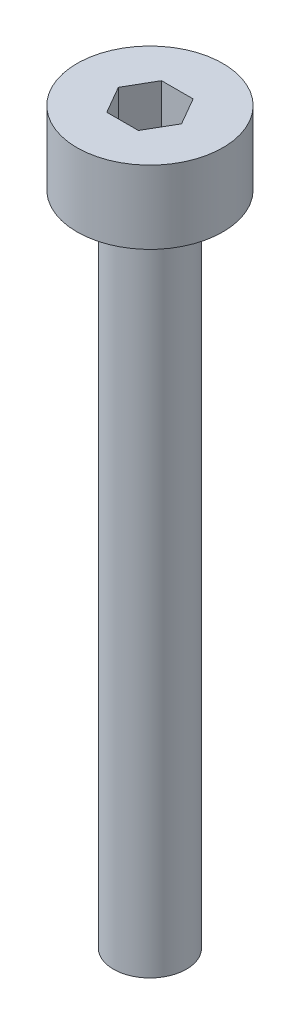
ISO-10303-21;
HEADER;
FILE_DESCRIPTION(('STEP AP214'),'2;1');
FILE_NAME('part.step','',(''),(''),'','','');
FILE_SCHEMA(('AUTOMOTIVE_DESIGN { 1 0 10303 214 1 1 1 1 }'));
ENDSEC;
DATA;
#1=APPLICATION_CONTEXT('core data for automotive mechanical design processes');
#2=APPLICATION_PROTOCOL_DEFINITION('international standard','automotive_design',2000,#1);
#3=PRODUCT_CONTEXT('',#1,'mechanical');
#4=PRODUCT('Part','Part','',(#3));
#5=PRODUCT_RELATED_PRODUCT_CATEGORY('part','',(#4));
#6=PRODUCT_DEFINITION_FORMATION('','',#4);
#7=PRODUCT_DEFINITION_CONTEXT('part definition',#1,'design');
#8=PRODUCT_DEFINITION('design','',#6,#7);
#9=PRODUCT_DEFINITION_SHAPE('','',#8);
#10=(LENGTH_UNIT() NAMED_UNIT(*) SI_UNIT(.MILLI.,.METRE.));
#11=(NAMED_UNIT(*) PLANE_ANGLE_UNIT() SI_UNIT($,.RADIAN.));
#12=(NAMED_UNIT(*) SI_UNIT($,.STERADIAN.) SOLID_ANGLE_UNIT());
#13=UNCERTAINTY_MEASURE_WITH_UNIT(LENGTH_MEASURE(1.E-05),#10,'distance_accuracy_value','');
#14=(GEOMETRIC_REPRESENTATION_CONTEXT(3) GLOBAL_UNCERTAINTY_ASSIGNED_CONTEXT((#13)) GLOBAL_UNIT_ASSIGNED_CONTEXT((#10,
#11,#12)) REPRESENTATION_CONTEXT('',''));
#15=CARTESIAN_POINT('',(0.,0.,0.));
#16=DIRECTION('',(0.,0.,1.));
#17=DIRECTION('',(1.,0.,0.));
#18=AXIS2_PLACEMENT_3D('',#15,#16,#17);
#19=CARTESIAN_POINT('',(0.,2.,0.));
#20=DIRECTION('',(0.,-1.,0.));
#21=DIRECTION('',(0.,0.,-1.));
#22=AXIS2_PLACEMENT_3D('',#19,#20,#21);
#23=CYLINDRICAL_SURFACE('',#22,2.);
#24=CARTESIAN_POINT('',(0.,2.,0.));
#25=DIRECTION('',(0.,1.,0.));
#26=DIRECTION('',(0.,0.,1.));
#27=AXIS2_PLACEMENT_3D('',#24,#25,#26);
#28=CIRCLE('',#27,2.);
#29=CARTESIAN_POINT('',(0.,2.,2.));
#30=VERTEX_POINT('',#29);
#31=EDGE_CURVE('E42',#30,#30,#28,.T.);
#32=ORIENTED_EDGE('',*,*,#31,.F.);
#33=EDGE_LOOP('',(#32));
#34=FACE_BOUND('',#33,.T.);
#35=CARTESIAN_POINT('',(0.,0.,0.));
#36=DIRECTION('',(0.,1.,0.));
#37=DIRECTION('',(0.,0.,1.));
#38=AXIS2_PLACEMENT_3D('',#35,#36,#37);
#39=CIRCLE('',#38,2.);
#40=CARTESIAN_POINT('',(0.,0.,2.));
#41=VERTEX_POINT('',#40);
#42=EDGE_CURVE('E37',#41,#41,#39,.T.);
#43=ORIENTED_EDGE('',*,*,#42,.T.);
#44=EDGE_LOOP('',(#43));
#45=FACE_BOUND('',#44,.T.);
#46=ADVANCED_FACE('F34',(#34,#45),#23,.T.);
#47=CARTESIAN_POINT('',(0.,2.,0.));
#48=DIRECTION('',(0.,1.,0.));
#49=DIRECTION('',(0.,0.,1.));
#50=AXIS2_PLACEMENT_3D('',#47,#48,#49);
#51=PLANE('',#50);
#52=DIRECTION('',(0.5,0.,-0.866025403784439));
#53=VECTOR('',#52,1.);
#54=CARTESIAN_POINT('',(0.433012701892219,2.,0.75));
#55=LINE('',#54,#53);
#56=CARTESIAN_POINT('',(0.433012701892219,2.,0.75));
#57=VERTEX_POINT('',#56);
#58=CARTESIAN_POINT('',(0.866025403784438,2.,0.));
#59=VERTEX_POINT('',#58);
#60=EDGE_CURVE('E50',#57,#59,#55,.T.);
#61=ORIENTED_EDGE('',*,*,#60,.F.);
#62=DIRECTION('',(1.,0.,0.));
#63=VECTOR('',#62,1.);
#64=CARTESIAN_POINT('',(-0.43301270189222,2.,0.75));
#65=LINE('',#64,#63);
#66=CARTESIAN_POINT('',(-0.43301270189222,2.,0.75));
#67=VERTEX_POINT('',#66);
#68=EDGE_CURVE('E134',#67,#57,#65,.T.);
#69=ORIENTED_EDGE('',*,*,#68,.F.);
#70=DIRECTION('',(0.5,0.,0.866025403784439));
#71=VECTOR('',#70,1.);
#72=CARTESIAN_POINT('',(-0.866025403784439,2.,0.));
#73=LINE('',#72,#71);
#74=CARTESIAN_POINT('',(-0.866025403784439,2.,0.));
#75=VERTEX_POINT('',#74);
#76=EDGE_CURVE('E132',#75,#67,#73,.T.);
#77=ORIENTED_EDGE('',*,*,#76,.F.);
#78=DIRECTION('',(-0.5,0.,0.866025403784439));
#79=VECTOR('',#78,1.);
#80=CARTESIAN_POINT('',(-0.43301270189222,2.,-0.750000000000001));
#81=LINE('',#80,#79);
#82=CARTESIAN_POINT('',(-0.43301270189222,2.,-0.750000000000001));
#83=VERTEX_POINT('',#82);
#84=EDGE_CURVE('E98',#83,#75,#81,.T.);
#85=ORIENTED_EDGE('',*,*,#84,.F.);
#86=DIRECTION('',(-1.,0.,0.));
#87=VECTOR('',#86,1.);
#88=CARTESIAN_POINT('',(0.433012701892219,2.,-0.75));
#89=LINE('',#88,#87);
#90=CARTESIAN_POINT('',(0.433012701892219,2.,-0.75));
#91=VERTEX_POINT('',#90);
#92=EDGE_CURVE('E128',#91,#83,#89,.T.);
#93=ORIENTED_EDGE('',*,*,#92,.F.);
#94=DIRECTION('',(-0.5,0.,-0.866025403784439));
#95=VECTOR('',#94,1.);
#96=CARTESIAN_POINT('',(0.866025403784438,2.,0.));
#97=LINE('',#96,#95);
#98=EDGE_CURVE('E124',#59,#91,#97,.T.);
#99=ORIENTED_EDGE('',*,*,#98,.F.);
#100=EDGE_LOOP('',(#61,#69,#77,#85,#93,#99));
#101=FACE_BOUND('',#100,.T.);
#102=ORIENTED_EDGE('',*,*,#31,.T.);
#103=EDGE_LOOP('',(#102));
#104=FACE_BOUND('',#103,.T.);
#105=ADVANCED_FACE('F152',(#101,#104),#51,.T.);
#106=CARTESIAN_POINT('',(0.,0.,0.));
#107=DIRECTION('',(0.,1.,0.));
#108=DIRECTION('',(0.,0.,1.));
#109=AXIS2_PLACEMENT_3D('',#106,#107,#108);
#110=PLANE('',#109);
#111=CARTESIAN_POINT('',(0.,0.,0.));
#112=DIRECTION('',(0.,-1.,0.));
#113=DIRECTION('',(0.,0.,-1.));
#114=AXIS2_PLACEMENT_3D('',#111,#112,#113);
#115=CIRCLE('',#114,1.);
#116=CARTESIAN_POINT('',(0.,0.,-1.));
#117=VERTEX_POINT('',#116);
#118=EDGE_CURVE('E11',#117,#117,#115,.T.);
#119=ORIENTED_EDGE('',*,*,#118,.F.);
#120=EDGE_LOOP('',(#119));
#121=FACE_BOUND('',#120,.T.);
#122=ORIENTED_EDGE('',*,*,#42,.F.);
#123=EDGE_LOOP('',(#122));
#124=FACE_BOUND('',#123,.T.);
#125=ADVANCED_FACE('F149',(#121,#124),#110,.F.);
#126=CARTESIAN_POINT('',(0.433012701892219,0.5,0.75));
#127=DIRECTION('',(0.866025403784439,0.,0.5));
#128=DIRECTION('',(0.5,0.,-0.866025403784439));
#129=AXIS2_PLACEMENT_3D('',#126,#127,#128);
#130=PLANE('',#129);
#131=ORIENTED_EDGE('',*,*,#60,.T.);
#132=DIRECTION('',(0.,1.,0.));
#133=VECTOR('',#132,1.);
#134=CARTESIAN_POINT('',(0.866025403784438,0.5,0.));
#135=LINE('',#134,#133);
#136=CARTESIAN_POINT('',(0.866025403784438,0.5,0.));
#137=VERTEX_POINT('',#136);
#138=EDGE_CURVE('E80',#137,#59,#135,.T.);
#139=ORIENTED_EDGE('',*,*,#138,.F.);
#140=DIRECTION('',(0.5,0.,-0.866025403784439));
#141=VECTOR('',#140,1.);
#142=CARTESIAN_POINT('',(0.433012701892219,0.5,0.75));
#143=LINE('',#142,#141);
#144=CARTESIAN_POINT('',(0.433012701892219,0.5,0.75));
#145=VERTEX_POINT('',#144);
#146=EDGE_CURVE('E136',#145,#137,#143,.T.);
#147=ORIENTED_EDGE('',*,*,#146,.F.);
#148=DIRECTION('',(0.,1.,0.));
#149=VECTOR('',#148,1.);
#150=CARTESIAN_POINT('',(0.433012701892219,0.5,0.75));
#151=LINE('',#150,#149);
#152=EDGE_CURVE('E58',#145,#57,#151,.T.);
#153=ORIENTED_EDGE('',*,*,#152,.T.);
#154=EDGE_LOOP('',(#131,#139,#147,#153));
#155=FACE_BOUND('',#154,.T.);
#156=ADVANCED_FACE('F151',(#155),#130,.F.);
#157=CARTESIAN_POINT('',(-0.43301270189222,0.5,0.75));
#158=DIRECTION('',(0.,0.,1.));
#159=DIRECTION('',(1.,0.,0.));
#160=AXIS2_PLACEMENT_3D('',#157,#158,#159);
#161=PLANE('',#160);
#162=ORIENTED_EDGE('',*,*,#68,.T.);
#163=ORIENTED_EDGE('',*,*,#152,.F.);
#164=DIRECTION('',(1.,0.,0.));
#165=VECTOR('',#164,1.);
#166=CARTESIAN_POINT('',(-0.43301270189222,0.5,0.75));
#167=LINE('',#166,#165);
#168=CARTESIAN_POINT('',(-0.43301270189222,0.5,0.75));
#169=VERTEX_POINT('',#168);
#170=EDGE_CURVE('E110',#169,#145,#167,.T.);
#171=ORIENTED_EDGE('',*,*,#170,.F.);
#172=DIRECTION('',(0.,1.,0.));
#173=VECTOR('',#172,1.);
#174=CARTESIAN_POINT('',(-0.43301270189222,0.5,0.75));
#175=LINE('',#174,#173);
#176=EDGE_CURVE('E102',#169,#67,#175,.T.);
#177=ORIENTED_EDGE('',*,*,#176,.T.);
#178=EDGE_LOOP('',(#162,#163,#171,#177));
#179=FACE_BOUND('',#178,.T.);
#180=ADVANCED_FACE('F158',(#179),#161,.F.);
#181=CARTESIAN_POINT('',(-0.866025403784439,0.5,0.));
#182=DIRECTION('',(-0.866025403784439,0.,0.5));
#183=DIRECTION('',(0.5,0.,0.866025403784439));
#184=AXIS2_PLACEMENT_3D('',#181,#182,#183);
#185=PLANE('',#184);
#186=ORIENTED_EDGE('',*,*,#76,.T.);
#187=ORIENTED_EDGE('',*,*,#176,.F.);
#188=DIRECTION('',(0.5,0.,0.866025403784439));
#189=VECTOR('',#188,1.);
#190=CARTESIAN_POINT('',(-0.866025403784439,0.5,0.));
#191=LINE('',#190,#189);
#192=CARTESIAN_POINT('',(-0.866025403784439,0.5,0.));
#193=VERTEX_POINT('',#192);
#194=EDGE_CURVE('E106',#193,#169,#191,.T.);
#195=ORIENTED_EDGE('',*,*,#194,.F.);
#196=DIRECTION('',(0.,1.,0.));
#197=VECTOR('',#196,1.);
#198=CARTESIAN_POINT('',(-0.866025403784439,0.5,0.));
#199=LINE('',#198,#197);
#200=EDGE_CURVE('E91',#193,#75,#199,.T.);
#201=ORIENTED_EDGE('',*,*,#200,.T.);
#202=EDGE_LOOP('',(#186,#187,#195,#201));
#203=FACE_BOUND('',#202,.T.);
#204=ADVANCED_FACE('F107',(#203),#185,.F.);
#205=CARTESIAN_POINT('',(-0.43301270189222,0.5,-0.750000000000001));
#206=DIRECTION('',(-0.866025403784439,0.,-0.5));
#207=DIRECTION('',(-0.5,0.,0.866025403784439));
#208=AXIS2_PLACEMENT_3D('',#205,#206,#207);
#209=PLANE('',#208);
#210=ORIENTED_EDGE('',*,*,#84,.T.);
#211=ORIENTED_EDGE('',*,*,#200,.F.);
#212=DIRECTION('',(-0.5,0.,0.866025403784439));
#213=VECTOR('',#212,1.);
#214=CARTESIAN_POINT('',(-0.43301270189222,0.5,-0.750000000000001));
#215=LINE('',#214,#213);
#216=CARTESIAN_POINT('',(-0.43301270189222,0.5,-0.750000000000001));
#217=VERTEX_POINT('',#216);
#218=EDGE_CURVE('E95',#217,#193,#215,.T.);
#219=ORIENTED_EDGE('',*,*,#218,.F.);
#220=DIRECTION('',(0.,1.,0.));
#221=VECTOR('',#220,1.);
#222=CARTESIAN_POINT('',(-0.43301270189222,0.5,-0.750000000000001));
#223=LINE('',#222,#221);
#224=EDGE_CURVE('E103',#217,#83,#223,.T.);
#225=ORIENTED_EDGE('',*,*,#224,.T.);
#226=EDGE_LOOP('',(#210,#211,#219,#225));
#227=FACE_BOUND('',#226,.T.);
#228=ADVANCED_FACE('F93',(#227),#209,.F.);
#229=CARTESIAN_POINT('',(0.433012701892219,0.5,-0.75));
#230=DIRECTION('',(0.,0.,-1.));
#231=DIRECTION('',(-1.,0.,0.));
#232=AXIS2_PLACEMENT_3D('',#229,#230,#231);
#233=PLANE('',#232);
#234=ORIENTED_EDGE('',*,*,#92,.T.);
#235=ORIENTED_EDGE('',*,*,#224,.F.);
#236=DIRECTION('',(-1.,0.,0.));
#237=VECTOR('',#236,1.);
#238=CARTESIAN_POINT('',(0.433012701892219,0.5,-0.75));
#239=LINE('',#238,#237);
#240=CARTESIAN_POINT('',(0.433012701892219,0.5,-0.75));
#241=VERTEX_POINT('',#240);
#242=EDGE_CURVE('E116',#241,#217,#239,.T.);
#243=ORIENTED_EDGE('',*,*,#242,.F.);
#244=DIRECTION('',(0.,1.,0.));
#245=VECTOR('',#244,1.);
#246=CARTESIAN_POINT('',(0.433012701892219,0.5,-0.75));
#247=LINE('',#246,#245);
#248=EDGE_CURVE('E140',#241,#91,#247,.T.);
#249=ORIENTED_EDGE('',*,*,#248,.T.);
#250=EDGE_LOOP('',(#234,#235,#243,#249));
#251=FACE_BOUND('',#250,.T.);
#252=ADVANCED_FACE('F203',(#251),#233,.F.);
#253=CARTESIAN_POINT('',(0.866025403784438,0.5,0.));
#254=DIRECTION('',(0.866025403784438,0.,-0.5));
#255=DIRECTION('',(-0.5,0.,-0.866025403784439));
#256=AXIS2_PLACEMENT_3D('',#253,#254,#255);
#257=PLANE('',#256);
#258=ORIENTED_EDGE('',*,*,#98,.T.);
#259=ORIENTED_EDGE('',*,*,#248,.F.);
#260=DIRECTION('',(-0.5,0.,-0.866025403784439));
#261=VECTOR('',#260,1.);
#262=CARTESIAN_POINT('',(0.866025403784438,0.5,0.));
#263=LINE('',#262,#261);
#264=EDGE_CURVE('E118',#137,#241,#263,.T.);
#265=ORIENTED_EDGE('',*,*,#264,.F.);
#266=ORIENTED_EDGE('',*,*,#138,.T.);
#267=EDGE_LOOP('',(#258,#259,#265,#266));
#268=FACE_BOUND('',#267,.T.);
#269=ADVANCED_FACE('F212',(#268),#257,.F.);
#270=CARTESIAN_POINT('',(0.,0.5,0.));
#271=DIRECTION('',(0.,1.,0.));
#272=DIRECTION('',(0.,0.,1.));
#273=AXIS2_PLACEMENT_3D('',#270,#271,#272);
#274=PLANE('',#273);
#275=ORIENTED_EDGE('',*,*,#146,.T.);
#276=ORIENTED_EDGE('',*,*,#264,.T.);
#277=ORIENTED_EDGE('',*,*,#242,.T.);
#278=ORIENTED_EDGE('',*,*,#218,.T.);
#279=ORIENTED_EDGE('',*,*,#194,.T.);
#280=ORIENTED_EDGE('',*,*,#170,.T.);
#281=EDGE_LOOP('',(#275,#276,#277,#278,#279,#280));
#282=FACE_BOUND('',#281,.T.);
#283=ADVANCED_FACE('F113',(#282),#274,.T.);
#284=CARTESIAN_POINT('',(0.,-18.,0.));
#285=DIRECTION('',(0.,1.,0.));
#286=DIRECTION('',(0.,0.,1.));
#287=AXIS2_PLACEMENT_3D('',#284,#285,#286);
#288=CYLINDRICAL_SURFACE('',#287,1.);
#289=CARTESIAN_POINT('',(0.,-18.,0.));
#290=DIRECTION('',(0.,-1.,0.));
#291=DIRECTION('',(0.,0.,-1.));
#292=AXIS2_PLACEMENT_3D('',#289,#290,#291);
#293=CIRCLE('',#292,1.);
#294=CARTESIAN_POINT('',(0.,-18.,-1.));
#295=VERTEX_POINT('',#294);
#296=EDGE_CURVE('E125',#295,#295,#293,.T.);
#297=ORIENTED_EDGE('',*,*,#296,.F.);
#298=EDGE_LOOP('',(#297));
#299=FACE_BOUND('',#298,.T.);
#300=ORIENTED_EDGE('',*,*,#118,.T.);
#301=EDGE_LOOP('',(#300));
#302=FACE_BOUND('',#301,.T.);
#303=ADVANCED_FACE('F230',(#299,#302),#288,.T.);
#304=CARTESIAN_POINT('',(0.,-18.,0.));
#305=DIRECTION('',(0.,-1.,0.));
#306=DIRECTION('',(0.,0.,-1.));
#307=AXIS2_PLACEMENT_3D('',#304,#305,#306);
#308=PLANE('',#307);
#309=ORIENTED_EDGE('',*,*,#296,.T.);
#310=EDGE_LOOP('',(#309));
#311=FACE_BOUND('',#310,.T.);
#312=ADVANCED_FACE('F243',(#311),#308,.T.);
#313=CLOSED_SHELL('',(#46,#105,#125,#156,#180,#204,#228,#252,#269,#283,#303,#312));
#314=MANIFOLD_SOLID_BREP('B2',#313);
#315=ADVANCED_BREP_SHAPE_REPRESENTATION('',(#18,#314),#14);
#316=SHAPE_DEFINITION_REPRESENTATION(#9,#315);
ENDSEC;
END-ISO-10303-21;
